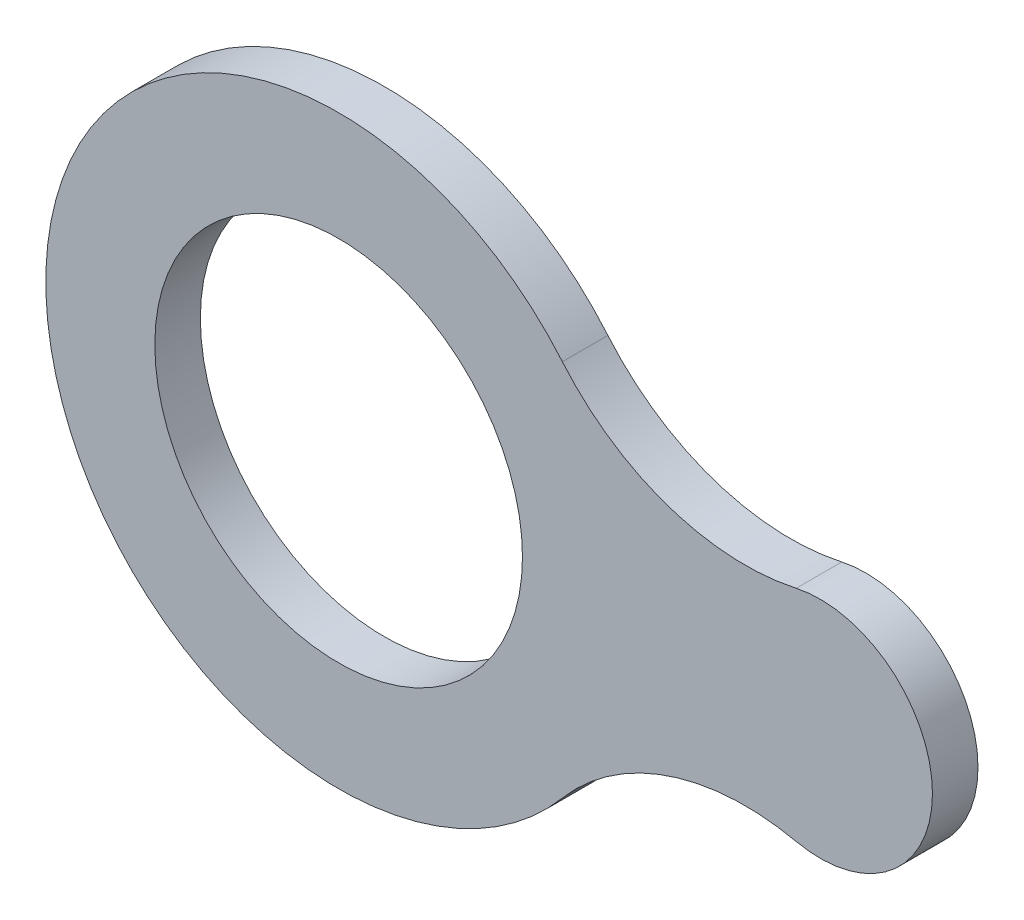
ISO-10303-21;
HEADER;
FILE_DESCRIPTION(('STEP AP214'),'2;1');
FILE_NAME('part.step','',(''),(''),'','','');
FILE_SCHEMA(('AUTOMOTIVE_DESIGN { 1 0 10303 214 1 1 1 1 }'));
ENDSEC;
DATA;
#1=APPLICATION_CONTEXT('core data for automotive mechanical design processes');
#2=APPLICATION_PROTOCOL_DEFINITION('international standard','automotive_design',2000,#1);
#3=PRODUCT_CONTEXT('',#1,'mechanical');
#4=PRODUCT('Part','Part','',(#3));
#5=PRODUCT_RELATED_PRODUCT_CATEGORY('part','',(#4));
#6=PRODUCT_DEFINITION_FORMATION('','',#4);
#7=PRODUCT_DEFINITION_CONTEXT('part definition',#1,'design');
#8=PRODUCT_DEFINITION('design','',#6,#7);
#9=PRODUCT_DEFINITION_SHAPE('','',#8);
#10=(LENGTH_UNIT() NAMED_UNIT(*) SI_UNIT(.MILLI.,.METRE.));
#11=(NAMED_UNIT(*) PLANE_ANGLE_UNIT() SI_UNIT($,.RADIAN.));
#12=(NAMED_UNIT(*) SI_UNIT($,.STERADIAN.) SOLID_ANGLE_UNIT());
#13=UNCERTAINTY_MEASURE_WITH_UNIT(LENGTH_MEASURE(1.E-05),#10,'distance_accuracy_value','');
#14=(GEOMETRIC_REPRESENTATION_CONTEXT(3) GLOBAL_UNCERTAINTY_ASSIGNED_CONTEXT((#13)) GLOBAL_UNIT_ASSIGNED_CONTEXT((#10,
#11,#12)) REPRESENTATION_CONTEXT('',''));
#15=CARTESIAN_POINT('',(0.,0.,0.));
#16=DIRECTION('',(0.,0.,1.));
#17=DIRECTION('',(1.,0.,0.));
#18=AXIS2_PLACEMENT_3D('',#15,#16,#17);
#19=CARTESIAN_POINT('',(68.2247620418789,26.3701987783427,6.99999999999981));
#20=DIRECTION('',(0.,0.,1.));
#21=DIRECTION('',(1.,0.,0.));
#22=AXIS2_PLACEMENT_3D('',#19,#20,#21);
#23=PLANE('',#22);
#24=CARTESIAN_POINT('',(62.4495240837573,52.7403975566849,7.00000000000003));
#25=DIRECTION('',(0.,0.,1.));
#26=DIRECTION('',(1.,0.,0.));
#27=AXIS2_PLACEMENT_3D('',#24,#25,#26);
#28=CIRCLE('',#27,36.740397556685);
#29=CARTESIAN_POINT('',(34.3799231196579,29.034821960648,7.00000000000012));
#30=VERTEX_POINT('',#29);
#31=CARTESIAN_POINT('',(70.3096084012724,16.8506234260948,7.00000000000012));
#32=VERTEX_POINT('',#31);
#33=EDGE_CURVE('E100',#30,#32,#28,.T.);
#34=ORIENTED_EDGE('',*,*,#33,.F.);
#35=CARTESIAN_POINT('',(1.11022302462516E-13,0.,7.0000000000002));
#36=DIRECTION('',(0.,0.,1.));
#37=DIRECTION('',(1.,0.,0.));
#38=AXIS2_PLACEMENT_3D('',#35,#36,#37);
#39=CIRCLE('',#38,45.);
#40=CARTESIAN_POINT('',(34.3799231196574,-29.0348219606458,7.00000000000012));
#41=VERTEX_POINT('',#40);
#42=EDGE_CURVE('E90',#30,#41,#39,.T.);
#43=ORIENTED_EDGE('',*,*,#42,.T.);
#44=CARTESIAN_POINT('',(62.4495240837575,-52.740397556684,7.00000000000012));
#45=DIRECTION('',(0.,0.,-1.));
#46=DIRECTION('',(-1.,0.,0.));
#47=AXIS2_PLACEMENT_3D('',#44,#45,#46);
#48=CIRCLE('',#47,36.740397556685);
#49=CARTESIAN_POINT('',(70.3096084012723,-16.8506234260941,7.00000000000012));
#50=VERTEX_POINT('',#49);
#51=EDGE_CURVE('E85',#41,#50,#48,.T.);
#52=ORIENTED_EDGE('',*,*,#51,.T.);
#53=CARTESIAN_POINT('',(74.0000000000006,4.44089209850063E-13,6.9999999999999));
#54=DIRECTION('',(0.,0.,-1.));
#55=DIRECTION('',(-1.,0.,0.));
#56=AXIS2_PLACEMENT_3D('',#53,#54,#55);
#57=CIRCLE('',#56,17.25);
#58=EDGE_CURVE('E89',#32,#50,#57,.T.);
#59=ORIENTED_EDGE('',*,*,#58,.F.);
#60=EDGE_LOOP('',(#34,#43,#52,#59));
#61=FACE_BOUND('',#60,.T.);
#62=CARTESIAN_POINT('',(1.11022302462516E-13,0.,7.0000000000002));
#63=DIRECTION('',(0.,0.,1.));
#64=DIRECTION('',(1.,0.,0.));
#65=AXIS2_PLACEMENT_3D('',#62,#63,#64);
#66=CIRCLE('',#65,28.25);
#67=CARTESIAN_POINT('',(28.2500000000002,0.,7.00000000000021));
#68=VERTEX_POINT('',#67);
#69=EDGE_CURVE('E110',#68,#68,#66,.T.);
#70=ORIENTED_EDGE('',*,*,#69,.F.);
#71=EDGE_LOOP('',(#70));
#72=FACE_BOUND('',#71,.T.);
#73=ADVANCED_FACE('F39',(#61,#72),#23,.T.);
#74=CARTESIAN_POINT('',(68.2247620418789,26.3701987783433,1.38777878078145E-13));
#75=DIRECTION('',(0.,0.,1.));
#76=DIRECTION('',(1.,0.,0.));
#77=AXIS2_PLACEMENT_3D('',#74,#75,#76);
#78=PLANE('',#77);
#79=CARTESIAN_POINT('',(62.4495240837577,52.7403975566851,0.));
#80=DIRECTION('',(0.,0.,1.));
#81=DIRECTION('',(1.,0.,0.));
#82=AXIS2_PLACEMENT_3D('',#79,#80,#81);
#83=CIRCLE('',#82,36.740397556685);
#84=CARTESIAN_POINT('',(34.3799231196579,29.034821960648,0.));
#85=VERTEX_POINT('',#84);
#86=CARTESIAN_POINT('',(70.3096084012725,16.8506234260959,0.));
#87=VERTEX_POINT('',#86);
#88=EDGE_CURVE('E106',#85,#87,#83,.T.);
#89=ORIENTED_EDGE('',*,*,#88,.T.);
#90=CARTESIAN_POINT('',(74.0000000000011,4.44089209850063E-13,0.));
#91=DIRECTION('',(0.,0.,-1.));
#92=DIRECTION('',(-1.,0.,0.));
#93=AXIS2_PLACEMENT_3D('',#90,#91,#92);
#94=CIRCLE('',#93,17.25);
#95=CARTESIAN_POINT('',(70.3096084012723,-16.8506234260941,0.));
#96=VERTEX_POINT('',#95);
#97=EDGE_CURVE('E109',#87,#96,#94,.T.);
#98=ORIENTED_EDGE('',*,*,#97,.T.);
#99=CARTESIAN_POINT('',(62.4495240837578,-52.7403975566849,0.));
#100=DIRECTION('',(0.,0.,-1.));
#101=DIRECTION('',(-1.,0.,0.));
#102=AXIS2_PLACEMENT_3D('',#99,#100,#101);
#103=CIRCLE('',#102,36.740397556685);
#104=CARTESIAN_POINT('',(34.3799231196578,-29.0348219606451,0.));
#105=VERTEX_POINT('',#104);
#106=EDGE_CURVE('E97',#105,#96,#103,.T.);
#107=ORIENTED_EDGE('',*,*,#106,.F.);
#108=CARTESIAN_POINT('',(0.,0.,0.));
#109=DIRECTION('',(0.,0.,1.));
#110=DIRECTION('',(1.,0.,0.));
#111=AXIS2_PLACEMENT_3D('',#108,#109,#110);
#112=CIRCLE('',#111,45.);
#113=EDGE_CURVE('E73',#85,#105,#112,.T.);
#114=ORIENTED_EDGE('',*,*,#113,.F.);
#115=EDGE_LOOP('',(#89,#98,#107,#114));
#116=FACE_BOUND('',#115,.T.);
#117=CARTESIAN_POINT('',(0.,0.,0.));
#118=DIRECTION('',(0.,0.,1.));
#119=DIRECTION('',(1.,0.,0.));
#120=AXIS2_PLACEMENT_3D('',#117,#118,#119);
#121=CIRCLE('',#120,28.25);
#122=CARTESIAN_POINT('',(28.2500000000001,0.,0.));
#123=VERTEX_POINT('',#122);
#124=EDGE_CURVE('E145',#123,#123,#121,.T.);
#125=ORIENTED_EDGE('',*,*,#124,.T.);
#126=EDGE_LOOP('',(#125));
#127=FACE_BOUND('',#126,.T.);
#128=ADVANCED_FACE('F115',(#116,#127),#78,.F.);
#129=CARTESIAN_POINT('',(62.4495240837573,52.7403975566849,7.00000000000003));
#130=DIRECTION('',(0.,0.,-1.));
#131=DIRECTION('',(-1.,0.,0.));
#132=AXIS2_PLACEMENT_3D('',#129,#130,#131);
#133=CYLINDRICAL_SURFACE('',#132,36.740397556685);
#134=ORIENTED_EDGE('',*,*,#88,.F.);
#135=DIRECTION('',(0.,0.,-1.));
#136=VECTOR('',#135,1.);
#137=CARTESIAN_POINT('',(34.3799231196579,29.034821960648,7.00000000000012));
#138=LINE('',#137,#136);
#139=EDGE_CURVE('E11',#30,#85,#138,.T.);
#140=ORIENTED_EDGE('',*,*,#139,.F.);
#141=ORIENTED_EDGE('',*,*,#33,.T.);
#142=DIRECTION('',(0.,0.,-1.));
#143=VECTOR('',#142,1.);
#144=CARTESIAN_POINT('',(70.3096084012724,16.8506234260948,7.00000000000012));
#145=LINE('',#144,#143);
#146=EDGE_CURVE('E43',#32,#87,#145,.T.);
#147=ORIENTED_EDGE('',*,*,#146,.T.);
#148=EDGE_LOOP('',(#134,#140,#141,#147));
#149=FACE_BOUND('',#148,.T.);
#150=ADVANCED_FACE('F41',(#149),#133,.F.);
#151=CARTESIAN_POINT('',(1.11022302462516E-13,0.,7.0000000000002));
#152=DIRECTION('',(0.,0.,-1.));
#153=DIRECTION('',(-1.,0.,0.));
#154=AXIS2_PLACEMENT_3D('',#151,#152,#153);
#155=CYLINDRICAL_SURFACE('',#154,45.);
#156=ORIENTED_EDGE('',*,*,#113,.T.);
#157=DIRECTION('',(0.,0.,-1.));
#158=VECTOR('',#157,1.);
#159=CARTESIAN_POINT('',(34.3799231196574,-29.0348219606458,7.00000000000012));
#160=LINE('',#159,#158);
#161=EDGE_CURVE('E49',#41,#105,#160,.T.);
#162=ORIENTED_EDGE('',*,*,#161,.F.);
#163=ORIENTED_EDGE('',*,*,#42,.F.);
#164=ORIENTED_EDGE('',*,*,#139,.T.);
#165=EDGE_LOOP('',(#156,#162,#163,#164));
#166=FACE_BOUND('',#165,.T.);
#167=ADVANCED_FACE('F118',(#166),#155,.T.);
#168=CARTESIAN_POINT('',(62.4495240837575,-52.740397556684,7.00000000000012));
#169=DIRECTION('',(0.,0.,-1.));
#170=DIRECTION('',(-1.,0.,0.));
#171=AXIS2_PLACEMENT_3D('',#168,#169,#170);
#172=CYLINDRICAL_SURFACE('',#171,36.740397556685);
#173=ORIENTED_EDGE('',*,*,#106,.T.);
#174=DIRECTION('',(0.,0.,-1.));
#175=VECTOR('',#174,1.);
#176=CARTESIAN_POINT('',(70.3096084012723,-16.8506234260941,7.00000000000012));
#177=LINE('',#176,#175);
#178=EDGE_CURVE('E94',#50,#96,#177,.T.);
#179=ORIENTED_EDGE('',*,*,#178,.F.);
#180=ORIENTED_EDGE('',*,*,#51,.F.);
#181=ORIENTED_EDGE('',*,*,#161,.T.);
#182=EDGE_LOOP('',(#173,#179,#180,#181));
#183=FACE_BOUND('',#182,.T.);
#184=ADVANCED_FACE('F95',(#183),#172,.F.);
#185=CARTESIAN_POINT('',(74.0000000000006,4.44089209850063E-13,6.9999999999999));
#186=DIRECTION('',(0.,0.,-1.));
#187=DIRECTION('',(-1.,0.,0.));
#188=AXIS2_PLACEMENT_3D('',#185,#186,#187);
#189=CYLINDRICAL_SURFACE('',#188,17.25);
#190=ORIENTED_EDGE('',*,*,#97,.F.);
#191=ORIENTED_EDGE('',*,*,#146,.F.);
#192=ORIENTED_EDGE('',*,*,#58,.T.);
#193=ORIENTED_EDGE('',*,*,#178,.T.);
#194=EDGE_LOOP('',(#190,#191,#192,#193));
#195=FACE_BOUND('',#194,.T.);
#196=ADVANCED_FACE('F99',(#195),#189,.T.);
#197=CARTESIAN_POINT('',(1.11022302462516E-13,0.,7.0000000000002));
#198=DIRECTION('',(0.,0.,-1.));
#199=DIRECTION('',(-1.,0.,0.));
#200=AXIS2_PLACEMENT_3D('',#197,#198,#199);
#201=CYLINDRICAL_SURFACE('',#200,28.25);
#202=ORIENTED_EDGE('',*,*,#69,.T.);
#203=EDGE_LOOP('',(#202));
#204=FACE_BOUND('',#203,.T.);
#205=ORIENTED_EDGE('',*,*,#124,.F.);
#206=EDGE_LOOP('',(#205));
#207=FACE_BOUND('',#206,.T.);
#208=ADVANCED_FACE('F130',(#204,#207),#201,.F.);
#209=CLOSED_SHELL('',(#73,#128,#150,#167,#184,#196,#208));
#210=MANIFOLD_SOLID_BREP('B2',#209);
#211=ADVANCED_BREP_SHAPE_REPRESENTATION('',(#18,#210),#14);
#212=SHAPE_DEFINITION_REPRESENTATION(#9,#211);
ENDSEC;
END-ISO-10303-21;
